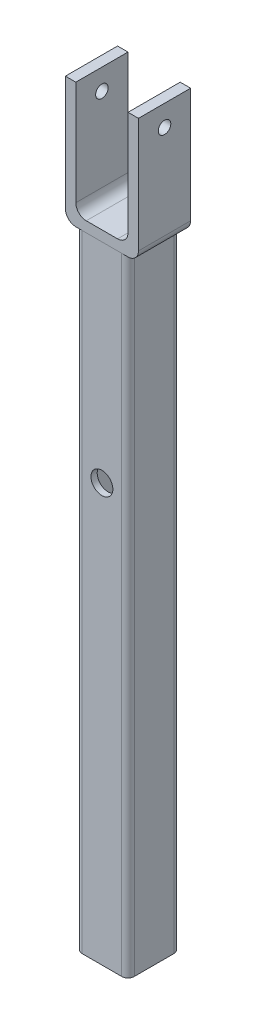
ISO-10303-21;
HEADER;
FILE_DESCRIPTION(('STEP AP214'),'2;1');
FILE_NAME('part.step','',(''),(''),'','','');
FILE_SCHEMA(('AUTOMOTIVE_DESIGN { 1 0 10303 214 1 1 1 1 }'));
ENDSEC;
DATA;
#1=APPLICATION_CONTEXT('core data for automotive mechanical design processes');
#2=APPLICATION_PROTOCOL_DEFINITION('international standard','automotive_design',2000,#1);
#3=PRODUCT_CONTEXT('',#1,'mechanical');
#4=PRODUCT('Part','Part','',(#3));
#5=PRODUCT_RELATED_PRODUCT_CATEGORY('part','',(#4));
#6=PRODUCT_DEFINITION_FORMATION('','',#4);
#7=PRODUCT_DEFINITION_CONTEXT('part definition',#1,'design');
#8=PRODUCT_DEFINITION('design','',#6,#7);
#9=PRODUCT_DEFINITION_SHAPE('','',#8);
#10=(LENGTH_UNIT() NAMED_UNIT(*) SI_UNIT(.MILLI.,.METRE.));
#11=(NAMED_UNIT(*) PLANE_ANGLE_UNIT() SI_UNIT($,.RADIAN.));
#12=(NAMED_UNIT(*) SI_UNIT($,.STERADIAN.) SOLID_ANGLE_UNIT());
#13=UNCERTAINTY_MEASURE_WITH_UNIT(LENGTH_MEASURE(1.E-05),#10,'distance_accuracy_value','');
#14=(GEOMETRIC_REPRESENTATION_CONTEXT(3) GLOBAL_UNCERTAINTY_ASSIGNED_CONTEXT((#13)) GLOBAL_UNIT_ASSIGNED_CONTEXT((#10,
#11,#12)) REPRESENTATION_CONTEXT('',''));
#15=CARTESIAN_POINT('',(0.,0.,0.));
#16=DIRECTION('',(0.,0.,1.));
#17=DIRECTION('',(1.,0.,0.));
#18=AXIS2_PLACEMENT_3D('',#15,#16,#17);
#19=CARTESIAN_POINT('',(0.,360.,0.));
#20=DIRECTION('',(0.,-1.,0.));
#21=DIRECTION('',(0.,0.,-1.));
#22=AXIS2_PLACEMENT_3D('',#19,#20,#21);
#23=PLANE('',#22);
#24=DIRECTION('',(1.,0.,0.));
#25=VECTOR('',#24,1.);
#26=CARTESIAN_POINT('',(17.5,360.,12.5));
#27=LINE('',#26,#25);
#28=CARTESIAN_POINT('',(-17.5,360.,12.5));
#29=VERTEX_POINT('',#28);
#30=CARTESIAN_POINT('',(-12.5,360.,12.5));
#31=VERTEX_POINT('',#30);
#32=EDGE_CURVE('E144',#29,#31,#27,.T.);
#33=ORIENTED_EDGE('',*,*,#32,.T.);
#34=DIRECTION('',(0.,0.,1.));
#35=VECTOR('',#34,1.);
#36=CARTESIAN_POINT('',(-12.5,360.,12.5));
#37=LINE('',#36,#35);
#38=CARTESIAN_POINT('',(-12.5,360.,-12.5));
#39=VERTEX_POINT('',#38);
#40=EDGE_CURVE('E154',#39,#31,#37,.T.);
#41=ORIENTED_EDGE('',*,*,#40,.F.);
#42=DIRECTION('',(-1.,0.,0.));
#43=VECTOR('',#42,1.);
#44=CARTESIAN_POINT('',(17.5,360.,-12.5));
#45=LINE('',#44,#43);
#46=CARTESIAN_POINT('',(-17.5,360.,-12.5));
#47=VERTEX_POINT('',#46);
#48=EDGE_CURVE('E169',#39,#47,#45,.T.);
#49=ORIENTED_EDGE('',*,*,#48,.T.);
#50=DIRECTION('',(0.,0.,1.));
#51=VECTOR('',#50,1.);
#52=CARTESIAN_POINT('',(-17.5,360.,-12.5));
#53=LINE('',#52,#51);
#54=EDGE_CURVE('E164',#47,#29,#53,.T.);
#55=ORIENTED_EDGE('',*,*,#54,.T.);
#56=EDGE_LOOP('',(#33,#41,#49,#55));
#57=FACE_BOUND('',#56,.T.);
#58=ADVANCED_FACE('F49',(#57),#23,.F.);
#59=CARTESIAN_POINT('',(-17.5,360.,-12.5));
#60=DIRECTION('',(1.,0.,0.));
#61=DIRECTION('',(0.,0.,-1.));
#62=AXIS2_PLACEMENT_3D('',#59,#60,#61);
#63=PLANE('',#62);
#64=CARTESIAN_POINT('',(-17.5,350.,0.));
#65=DIRECTION('',(-1.,0.,0.));
#66=DIRECTION('',(0.,0.,1.));
#67=AXIS2_PLACEMENT_3D('',#64,#65,#66);
#68=CIRCLE('',#67,3.);
#69=CARTESIAN_POINT('',(-17.5,350.,3.));
#70=VERTEX_POINT('',#69);
#71=EDGE_CURVE('E197',#70,#70,#68,.T.);
#72=ORIENTED_EDGE('',*,*,#71,.F.);
#73=EDGE_LOOP('',(#72));
#74=FACE_BOUND('',#73,.T.);
#75=DIRECTION('',(0.,-1.,0.));
#76=VECTOR('',#75,1.);
#77=CARTESIAN_POINT('',(-17.5,360.,-12.5));
#78=LINE('',#77,#76);
#79=CARTESIAN_POINT('',(-17.5,305.,-12.5));
#80=VERTEX_POINT('',#79);
#81=EDGE_CURVE('E176',#47,#80,#78,.T.);
#82=ORIENTED_EDGE('',*,*,#81,.T.);
#83=DIRECTION('',(0.,0.,1.));
#84=VECTOR('',#83,1.);
#85=CARTESIAN_POINT('',(-17.5,305.,12.5));
#86=LINE('',#85,#84);
#87=CARTESIAN_POINT('',(-17.5,305.,12.5));
#88=VERTEX_POINT('',#87);
#89=EDGE_CURVE('E12',#80,#88,#86,.T.);
#90=ORIENTED_EDGE('',*,*,#89,.T.);
#91=DIRECTION('',(0.,-1.,0.));
#92=VECTOR('',#91,1.);
#93=CARTESIAN_POINT('',(-17.5,360.,12.5));
#94=LINE('',#93,#92);
#95=EDGE_CURVE('E190',#29,#88,#94,.T.);
#96=ORIENTED_EDGE('',*,*,#95,.F.);
#97=ORIENTED_EDGE('',*,*,#54,.F.);
#98=EDGE_LOOP('',(#82,#90,#96,#97));
#99=FACE_BOUND('',#98,.T.);
#100=ADVANCED_FACE('F241',(#74,#99),#63,.F.);
#101=CARTESIAN_POINT('',(17.5,360.,12.5));
#102=DIRECTION('',(0.,0.,-1.));
#103=DIRECTION('',(-1.,0.,0.));
#104=AXIS2_PLACEMENT_3D('',#101,#102,#103);
#105=PLANE('',#104);
#106=DIRECTION('',(1.,0.,0.));
#107=VECTOR('',#106,1.);
#108=CARTESIAN_POINT('',(17.5,300.,12.5));
#109=LINE('',#108,#107);
#110=CARTESIAN_POINT('',(-12.5,300.,12.5));
#111=VERTEX_POINT('',#110);
#112=CARTESIAN_POINT('',(12.5,300.,12.5));
#113=VERTEX_POINT('',#112);
#114=EDGE_CURVE('E177',#111,#113,#109,.T.);
#115=ORIENTED_EDGE('',*,*,#114,.T.);
#116=CARTESIAN_POINT('',(12.5,305.,12.5));
#117=DIRECTION('',(0.,0.,-1.));
#118=DIRECTION('',(-1.,0.,0.));
#119=AXIS2_PLACEMENT_3D('',#116,#117,#118);
#120=CIRCLE('',#119,5.);
#121=CARTESIAN_POINT('',(17.5,305.,12.5));
#122=VERTEX_POINT('',#121);
#123=EDGE_CURVE('E57',#113,#122,#120,.F.);
#124=ORIENTED_EDGE('',*,*,#123,.T.);
#125=DIRECTION('',(0.,-1.,0.));
#126=VECTOR('',#125,1.);
#127=CARTESIAN_POINT('',(17.5,360.,12.5));
#128=LINE('',#127,#126);
#129=CARTESIAN_POINT('',(17.5,360.,12.5));
#130=VERTEX_POINT('',#129);
#131=EDGE_CURVE('E187',#130,#122,#128,.T.);
#132=ORIENTED_EDGE('',*,*,#131,.F.);
#133=CARTESIAN_POINT('',(12.5,360.,12.5));
#134=VERTEX_POINT('',#133);
#135=EDGE_CURVE('E167',#134,#130,#27,.T.);
#136=ORIENTED_EDGE('',*,*,#135,.F.);
#137=DIRECTION('',(0.,1.,0.));
#138=VECTOR('',#137,1.);
#139=CARTESIAN_POINT('',(12.5,305.,12.5));
#140=LINE('',#139,#138);
#141=CARTESIAN_POINT('',(12.5,310.,12.5));
#142=VERTEX_POINT('',#141);
#143=EDGE_CURVE('E150',#142,#134,#140,.T.);
#144=ORIENTED_EDGE('',*,*,#143,.F.);
#145=CARTESIAN_POINT('',(7.5,310.,12.5));
#146=DIRECTION('',(0.,0.,-1.));
#147=DIRECTION('',(-1.,0.,0.));
#148=AXIS2_PLACEMENT_3D('',#145,#146,#147);
#149=CIRCLE('',#148,5.);
#150=CARTESIAN_POINT('',(7.5,305.,12.5));
#151=VERTEX_POINT('',#150);
#152=EDGE_CURVE('E209',#142,#151,#149,.T.);
#153=ORIENTED_EDGE('',*,*,#152,.T.);
#154=DIRECTION('',(1.,0.,0.));
#155=VECTOR('',#154,1.);
#156=CARTESIAN_POINT('',(12.5,305.,12.5));
#157=LINE('',#156,#155);
#158=CARTESIAN_POINT('',(-7.49999999999999,305.,12.5));
#159=VERTEX_POINT('',#158);
#160=EDGE_CURVE('E393',#159,#151,#157,.T.);
#161=ORIENTED_EDGE('',*,*,#160,.F.);
#162=CARTESIAN_POINT('',(-7.5,310.,12.5));
#163=DIRECTION('',(0.,0.,-1.));
#164=DIRECTION('',(-1.,0.,0.));
#165=AXIS2_PLACEMENT_3D('',#162,#163,#164);
#166=CIRCLE('',#165,5.);
#167=CARTESIAN_POINT('',(-12.5,310.,12.5));
#168=VERTEX_POINT('',#167);
#169=EDGE_CURVE('E147',#159,#168,#166,.T.);
#170=ORIENTED_EDGE('',*,*,#169,.T.);
#171=DIRECTION('',(0.,1.,0.));
#172=VECTOR('',#171,1.);
#173=CARTESIAN_POINT('',(-12.5,305.,12.5));
#174=LINE('',#173,#172);
#175=EDGE_CURVE('E139',#168,#31,#174,.T.);
#176=ORIENTED_EDGE('',*,*,#175,.T.);
#177=ORIENTED_EDGE('',*,*,#32,.F.);
#178=ORIENTED_EDGE('',*,*,#95,.T.);
#179=CARTESIAN_POINT('',(-12.5,305.,12.5));
#180=DIRECTION('',(0.,0.,-1.));
#181=DIRECTION('',(-1.,0.,0.));
#182=AXIS2_PLACEMENT_3D('',#179,#180,#181);
#183=CIRCLE('',#182,5.);
#184=EDGE_CURVE('E64',#88,#111,#183,.F.);
#185=ORIENTED_EDGE('',*,*,#184,.T.);
#186=EDGE_LOOP('',(#115,#124,#132,#136,#144,#153,#161,#170,#176,#177,#178,#185));
#187=FACE_BOUND('',#186,.T.);
#188=ADVANCED_FACE('F141',(#187),#105,.F.);
#189=CARTESIAN_POINT('',(17.5,360.,-12.5));
#190=DIRECTION('',(-1.,0.,0.));
#191=DIRECTION('',(0.,0.,1.));
#192=AXIS2_PLACEMENT_3D('',#189,#190,#191);
#193=PLANE('',#192);
#194=CARTESIAN_POINT('',(17.5,350.,0.));
#195=DIRECTION('',(-1.,0.,0.));
#196=DIRECTION('',(0.,0.,1.));
#197=AXIS2_PLACEMENT_3D('',#194,#195,#196);
#198=CIRCLE('',#197,3.);
#199=CARTESIAN_POINT('',(17.5,350.,3.));
#200=VERTEX_POINT('',#199);
#201=EDGE_CURVE('E161',#200,#200,#198,.T.);
#202=ORIENTED_EDGE('',*,*,#201,.T.);
#203=EDGE_LOOP('',(#202));
#204=FACE_BOUND('',#203,.T.);
#205=ORIENTED_EDGE('',*,*,#131,.T.);
#206=DIRECTION('',(0.,0.,-1.));
#207=VECTOR('',#206,1.);
#208=CARTESIAN_POINT('',(17.5,305.,-12.5));
#209=LINE('',#208,#207);
#210=CARTESIAN_POINT('',(17.5,305.,-12.5));
#211=VERTEX_POINT('',#210);
#212=EDGE_CURVE('E214',#122,#211,#209,.T.);
#213=ORIENTED_EDGE('',*,*,#212,.T.);
#214=DIRECTION('',(0.,-1.,0.));
#215=VECTOR('',#214,1.);
#216=CARTESIAN_POINT('',(17.5,360.,-12.5));
#217=LINE('',#216,#215);
#218=CARTESIAN_POINT('',(17.5,360.,-12.5));
#219=VERTEX_POINT('',#218);
#220=EDGE_CURVE('E184',#219,#211,#217,.T.);
#221=ORIENTED_EDGE('',*,*,#220,.F.);
#222=DIRECTION('',(0.,0.,-1.));
#223=VECTOR('',#222,1.);
#224=CARTESIAN_POINT('',(17.5,360.,-12.5));
#225=LINE('',#224,#223);
#226=EDGE_CURVE('E166',#130,#219,#225,.T.);
#227=ORIENTED_EDGE('',*,*,#226,.F.);
#228=EDGE_LOOP('',(#205,#213,#221,#227));
#229=FACE_BOUND('',#228,.T.);
#230=ADVANCED_FACE('F231',(#204,#229),#193,.F.);
#231=CARTESIAN_POINT('',(17.5,360.,-12.5));
#232=DIRECTION('',(0.,0.,1.));
#233=DIRECTION('',(1.,0.,0.));
#234=AXIS2_PLACEMENT_3D('',#231,#232,#233);
#235=PLANE('',#234);
#236=ORIENTED_EDGE('',*,*,#220,.T.);
#237=CARTESIAN_POINT('',(12.5,305.,-12.5));
#238=DIRECTION('',(0.,0.,1.));
#239=DIRECTION('',(1.,0.,0.));
#240=AXIS2_PLACEMENT_3D('',#237,#238,#239);
#241=CIRCLE('',#240,5.);
#242=CARTESIAN_POINT('',(12.5,300.,-12.5));
#243=VERTEX_POINT('',#242);
#244=EDGE_CURVE('E219',#211,#243,#241,.F.);
#245=ORIENTED_EDGE('',*,*,#244,.T.);
#246=DIRECTION('',(-1.,0.,0.));
#247=VECTOR('',#246,1.);
#248=CARTESIAN_POINT('',(17.5,300.,-12.5));
#249=LINE('',#248,#247);
#250=CARTESIAN_POINT('',(-12.5,300.,-12.5));
#251=VERTEX_POINT('',#250);
#252=EDGE_CURVE('E179',#243,#251,#249,.T.);
#253=ORIENTED_EDGE('',*,*,#252,.T.);
#254=CARTESIAN_POINT('',(-12.5,305.,-12.5));
#255=DIRECTION('',(0.,0.,1.));
#256=DIRECTION('',(1.,0.,0.));
#257=AXIS2_PLACEMENT_3D('',#254,#255,#256);
#258=CIRCLE('',#257,5.);
#259=EDGE_CURVE('E217',#251,#80,#258,.F.);
#260=ORIENTED_EDGE('',*,*,#259,.T.);
#261=ORIENTED_EDGE('',*,*,#81,.F.);
#262=ORIENTED_EDGE('',*,*,#48,.F.);
#263=DIRECTION('',(0.,1.,0.));
#264=VECTOR('',#263,1.);
#265=CARTESIAN_POINT('',(-12.5,305.,-12.5));
#266=LINE('',#265,#264);
#267=CARTESIAN_POINT('',(-12.5,310.,-12.5));
#268=VERTEX_POINT('',#267);
#269=EDGE_CURVE('E157',#268,#39,#266,.T.);
#270=ORIENTED_EDGE('',*,*,#269,.F.);
#271=CARTESIAN_POINT('',(-7.5,310.,-12.5));
#272=DIRECTION('',(0.,0.,1.));
#273=DIRECTION('',(1.,0.,0.));
#274=AXIS2_PLACEMENT_3D('',#271,#272,#273);
#275=CIRCLE('',#274,5.);
#276=CARTESIAN_POINT('',(-7.49999999999999,305.,-12.5));
#277=VERTEX_POINT('',#276);
#278=EDGE_CURVE('E212',#268,#277,#275,.T.);
#279=ORIENTED_EDGE('',*,*,#278,.T.);
#280=DIRECTION('',(-1.,0.,0.));
#281=VECTOR('',#280,1.);
#282=CARTESIAN_POINT('',(12.5,305.,-12.5));
#283=LINE('',#282,#281);
#284=CARTESIAN_POINT('',(7.5,305.,-12.5));
#285=VERTEX_POINT('',#284);
#286=EDGE_CURVE('E151',#285,#277,#283,.T.);
#287=ORIENTED_EDGE('',*,*,#286,.F.);
#288=CARTESIAN_POINT('',(7.5,310.,-12.5));
#289=DIRECTION('',(0.,0.,1.));
#290=DIRECTION('',(1.,0.,0.));
#291=AXIS2_PLACEMENT_3D('',#288,#289,#290);
#292=CIRCLE('',#291,5.);
#293=CARTESIAN_POINT('',(12.5,310.,-12.5));
#294=VERTEX_POINT('',#293);
#295=EDGE_CURVE('E207',#285,#294,#292,.T.);
#296=ORIENTED_EDGE('',*,*,#295,.T.);
#297=DIRECTION('',(0.,1.,0.));
#298=VECTOR('',#297,1.);
#299=CARTESIAN_POINT('',(12.5,305.,-12.5));
#300=LINE('',#299,#298);
#301=CARTESIAN_POINT('',(12.5,360.,-12.5));
#302=VERTEX_POINT('',#301);
#303=EDGE_CURVE('E387',#294,#302,#300,.T.);
#304=ORIENTED_EDGE('',*,*,#303,.T.);
#305=EDGE_CURVE('E173',#219,#302,#45,.T.);
#306=ORIENTED_EDGE('',*,*,#305,.F.);
#307=EDGE_LOOP('',(#236,#245,#253,#260,#261,#262,#270,#279,#287,#296,#304,#306));
#308=FACE_BOUND('',#307,.T.);
#309=ADVANCED_FACE('F235',(#308),#235,.F.);
#310=ORIENTED_EDGE('',*,*,#305,.T.);
#311=DIRECTION('',(0.,0.,-1.));
#312=VECTOR('',#311,1.);
#313=CARTESIAN_POINT('',(12.5,360.,12.5));
#314=LINE('',#313,#312);
#315=EDGE_CURVE('E160',#134,#302,#314,.T.);
#316=ORIENTED_EDGE('',*,*,#315,.F.);
#317=ORIENTED_EDGE('',*,*,#135,.T.);
#318=ORIENTED_EDGE('',*,*,#226,.T.);
#319=EDGE_LOOP('',(#310,#316,#317,#318));
#320=FACE_BOUND('',#319,.T.);
#321=ADVANCED_FACE('F251',(#320),#23,.F.);
#322=CARTESIAN_POINT('',(0.,300.,0.));
#323=DIRECTION('',(0.,-1.,0.));
#324=DIRECTION('',(0.,0.,-1.));
#325=AXIS2_PLACEMENT_3D('',#322,#323,#324);
#326=PLANE('',#325);
#327=ORIENTED_EDGE('',*,*,#252,.F.);
#328=DIRECTION('',(0.,0.,-1.));
#329=VECTOR('',#328,1.);
#330=CARTESIAN_POINT('',(12.5,300.,12.5));
#331=LINE('',#330,#329);
#332=EDGE_CURVE('E71',#243,#113,#331,.F.);
#333=ORIENTED_EDGE('',*,*,#332,.T.);
#334=ORIENTED_EDGE('',*,*,#114,.F.);
#335=DIRECTION('',(0.,0.,1.));
#336=VECTOR('',#335,1.);
#337=CARTESIAN_POINT('',(-12.5,300.,-12.5));
#338=LINE('',#337,#336);
#339=EDGE_CURVE('E221',#111,#251,#338,.F.);
#340=ORIENTED_EDGE('',*,*,#339,.T.);
#341=EDGE_LOOP('',(#327,#333,#334,#340));
#342=FACE_BOUND('',#341,.T.);
#343=ADVANCED_FACE('F238',(#342),#326,.T.);
#344=CARTESIAN_POINT('',(-12.5,305.,12.5));
#345=DIRECTION('',(-1.,0.,0.));
#346=DIRECTION('',(0.,0.,1.));
#347=AXIS2_PLACEMENT_3D('',#344,#345,#346);
#348=PLANE('',#347);
#349=CARTESIAN_POINT('',(-12.5,350.,0.));
#350=DIRECTION('',(-1.,0.,0.));
#351=DIRECTION('',(0.,0.,1.));
#352=AXIS2_PLACEMENT_3D('',#349,#350,#351);
#353=CIRCLE('',#352,3.);
#354=CARTESIAN_POINT('',(-12.5,350.,3.));
#355=VERTEX_POINT('',#354);
#356=EDGE_CURVE('E196',#355,#355,#353,.T.);
#357=ORIENTED_EDGE('',*,*,#356,.T.);
#358=EDGE_LOOP('',(#357));
#359=FACE_BOUND('',#358,.T.);
#360=ORIENTED_EDGE('',*,*,#175,.F.);
#361=DIRECTION('',(0.,0.,1.));
#362=VECTOR('',#361,1.);
#363=CARTESIAN_POINT('',(-12.5,310.,12.5));
#364=LINE('',#363,#362);
#365=EDGE_CURVE('E205',#168,#268,#364,.F.);
#366=ORIENTED_EDGE('',*,*,#365,.T.);
#367=ORIENTED_EDGE('',*,*,#269,.T.);
#368=ORIENTED_EDGE('',*,*,#40,.T.);
#369=EDGE_LOOP('',(#360,#366,#367,#368));
#370=FACE_BOUND('',#369,.T.);
#371=ADVANCED_FACE('F155',(#359,#370),#348,.F.);
#372=CARTESIAN_POINT('',(12.5,305.,12.5));
#373=DIRECTION('',(1.,0.,0.));
#374=DIRECTION('',(0.,0.,-1.));
#375=AXIS2_PLACEMENT_3D('',#372,#373,#374);
#376=PLANE('',#375);
#377=CARTESIAN_POINT('',(12.5,350.,0.));
#378=DIRECTION('',(1.,0.,0.));
#379=DIRECTION('',(0.,0.,-1.));
#380=AXIS2_PLACEMENT_3D('',#377,#378,#379);
#381=CIRCLE('',#380,3.);
#382=CARTESIAN_POINT('',(12.5,350.,-3.));
#383=VERTEX_POINT('',#382);
#384=EDGE_CURVE('E193',#383,#383,#381,.T.);
#385=ORIENTED_EDGE('',*,*,#384,.T.);
#386=EDGE_LOOP('',(#385));
#387=FACE_BOUND('',#386,.T.);
#388=ORIENTED_EDGE('',*,*,#303,.F.);
#389=DIRECTION('',(0.,0.,-1.));
#390=VECTOR('',#389,1.);
#391=CARTESIAN_POINT('',(12.5,310.,12.5));
#392=LINE('',#391,#390);
#393=EDGE_CURVE('E203',#294,#142,#392,.F.);
#394=ORIENTED_EDGE('',*,*,#393,.T.);
#395=ORIENTED_EDGE('',*,*,#143,.T.);
#396=ORIENTED_EDGE('',*,*,#315,.T.);
#397=EDGE_LOOP('',(#388,#394,#395,#396));
#398=FACE_BOUND('',#397,.T.);
#399=ADVANCED_FACE('F336',(#387,#398),#376,.F.);
#400=CARTESIAN_POINT('',(0.,305.,0.));
#401=DIRECTION('',(0.,1.,0.));
#402=DIRECTION('',(0.,0.,1.));
#403=AXIS2_PLACEMENT_3D('',#400,#401,#402);
#404=PLANE('',#403);
#405=ORIENTED_EDGE('',*,*,#160,.T.);
#406=DIRECTION('',(0.,0.,-1.));
#407=VECTOR('',#406,1.);
#408=CARTESIAN_POINT('',(7.5,305.,0.));
#409=LINE('',#408,#407);
#410=EDGE_CURVE('E200',#151,#285,#409,.T.);
#411=ORIENTED_EDGE('',*,*,#410,.T.);
#412=ORIENTED_EDGE('',*,*,#286,.T.);
#413=DIRECTION('',(0.,0.,1.));
#414=VECTOR('',#413,1.);
#415=CARTESIAN_POINT('',(-7.5,305.,0.));
#416=LINE('',#415,#414);
#417=EDGE_CURVE('E192',#277,#159,#416,.T.);
#418=ORIENTED_EDGE('',*,*,#417,.T.);
#419=EDGE_LOOP('',(#405,#411,#412,#418));
#420=FACE_BOUND('',#419,.T.);
#421=ADVANCED_FACE('F330',(#420),#404,.T.);
#422=CARTESIAN_POINT('',(37.5,350.,0.));
#423=DIRECTION('',(-1.,0.,0.));
#424=DIRECTION('',(0.,0.,1.));
#425=AXIS2_PLACEMENT_3D('',#422,#423,#424);
#426=CYLINDRICAL_SURFACE('',#425,3.);
#427=ORIENTED_EDGE('',*,*,#384,.F.);
#428=EDGE_LOOP('',(#427));
#429=FACE_BOUND('',#428,.T.);
#430=ORIENTED_EDGE('',*,*,#201,.F.);
#431=EDGE_LOOP('',(#430));
#432=FACE_BOUND('',#431,.T.);
#433=ADVANCED_FACE('F335',(#429,#432),#426,.F.);
#434=ORIENTED_EDGE('',*,*,#71,.T.);
#435=EDGE_LOOP('',(#434));
#436=FACE_BOUND('',#435,.T.);
#437=ORIENTED_EDGE('',*,*,#356,.F.);
#438=EDGE_LOOP('',(#437));
#439=FACE_BOUND('',#438,.T.);
#440=ADVANCED_FACE('F259',(#436,#439),#426,.F.);
#441=CARTESIAN_POINT('',(7.5,310.,0.));
#442=DIRECTION('',(0.,0.,-1.));
#443=DIRECTION('',(-1.,0.,0.));
#444=AXIS2_PLACEMENT_3D('',#441,#442,#443);
#445=CYLINDRICAL_SURFACE('',#444,5.);
#446=ORIENTED_EDGE('',*,*,#152,.F.);
#447=ORIENTED_EDGE('',*,*,#393,.F.);
#448=ORIENTED_EDGE('',*,*,#295,.F.);
#449=ORIENTED_EDGE('',*,*,#410,.F.);
#450=EDGE_LOOP('',(#446,#447,#448,#449));
#451=FACE_BOUND('',#450,.T.);
#452=ADVANCED_FACE('F255',(#451),#445,.F.);
#453=CARTESIAN_POINT('',(-7.5,310.,0.));
#454=DIRECTION('',(0.,0.,1.));
#455=DIRECTION('',(1.,0.,0.));
#456=AXIS2_PLACEMENT_3D('',#453,#454,#455);
#457=CYLINDRICAL_SURFACE('',#456,5.);
#458=ORIENTED_EDGE('',*,*,#278,.F.);
#459=ORIENTED_EDGE('',*,*,#365,.F.);
#460=ORIENTED_EDGE('',*,*,#169,.F.);
#461=ORIENTED_EDGE('',*,*,#417,.F.);
#462=EDGE_LOOP('',(#458,#459,#460,#461));
#463=FACE_BOUND('',#462,.T.);
#464=ADVANCED_FACE('F258',(#463),#457,.F.);
#465=CARTESIAN_POINT('',(12.5,305.,-12.5));
#466=DIRECTION('',(0.,0.,1.));
#467=DIRECTION('',(1.,0.,0.));
#468=AXIS2_PLACEMENT_3D('',#465,#466,#467);
#469=CYLINDRICAL_SURFACE('',#468,5.);
#470=ORIENTED_EDGE('',*,*,#123,.F.);
#471=ORIENTED_EDGE('',*,*,#332,.F.);
#472=ORIENTED_EDGE('',*,*,#244,.F.);
#473=ORIENTED_EDGE('',*,*,#212,.F.);
#474=EDGE_LOOP('',(#470,#471,#472,#473));
#475=FACE_BOUND('',#474,.T.);
#476=ADVANCED_FACE('F233',(#475),#469,.T.);
#477=CARTESIAN_POINT('',(-12.5,305.,-12.5));
#478=DIRECTION('',(0.,0.,-1.));
#479=DIRECTION('',(-1.,0.,0.));
#480=AXIS2_PLACEMENT_3D('',#477,#478,#479);
#481=CYLINDRICAL_SURFACE('',#480,5.);
#482=ORIENTED_EDGE('',*,*,#259,.F.);
#483=ORIENTED_EDGE('',*,*,#339,.F.);
#484=ORIENTED_EDGE('',*,*,#184,.F.);
#485=ORIENTED_EDGE('',*,*,#89,.F.);
#486=EDGE_LOOP('',(#482,#483,#484,#485));
#487=FACE_BOUND('',#486,.T.);
#488=ADVANCED_FACE('F51',(#487),#481,.T.);
#489=CLOSED_SHELL('',(#58,#100,#188,#230,#309,#321,#343,#371,#399,#421,#433,#440,#452,#464,#476,#488));
#490=MANIFOLD_SOLID_BREP('B2',#489);
#491=CARTESIAN_POINT('',(-6.49999999999998,300.,-9.5));
#492=DIRECTION('',(0.,0.,1.));
#493=DIRECTION('',(1.,0.,0.));
#494=AXIS2_PLACEMENT_3D('',#491,#492,#493);
#495=PLANE('',#494);
#496=CARTESIAN_POINT('',(0.,200.,-9.49999999999999));
#497=DIRECTION('',(0.,0.,-1.));
#498=DIRECTION('',(-1.,0.,0.));
#499=AXIS2_PLACEMENT_3D('',#496,#497,#498);
#500=CIRCLE('',#499,7.5);
#501=CARTESIAN_POINT('',(-6.5,203.741657386774,-9.5));
#502=VERTEX_POINT('',#501);
#503=CARTESIAN_POINT('',(6.50000000000001,203.741657386774,-9.5));
#504=VERTEX_POINT('',#503);
#505=EDGE_CURVE('E435',#502,#504,#500,.T.);
#506=ORIENTED_EDGE('',*,*,#505,.T.);
#507=DIRECTION('',(0.,-1.,0.));
#508=VECTOR('',#507,1.);
#509=CARTESIAN_POINT('',(6.5,300.,-9.5));
#510=LINE('',#509,#508);
#511=CARTESIAN_POINT('',(6.5,300.,-9.5));
#512=VERTEX_POINT('',#511);
#513=EDGE_CURVE('E565',#512,#504,#510,.T.);
#514=ORIENTED_EDGE('',*,*,#513,.F.);
#515=DIRECTION('',(-1.,0.,0.));
#516=VECTOR('',#515,1.);
#517=CARTESIAN_POINT('',(-6.49999999999998,300.,-9.5));
#518=LINE('',#517,#516);
#519=CARTESIAN_POINT('',(-6.5,300.,-9.5));
#520=VERTEX_POINT('',#519);
#521=EDGE_CURVE('E807',#512,#520,#518,.T.);
#522=ORIENTED_EDGE('',*,*,#521,.T.);
#523=DIRECTION('',(0.,-1.,0.));
#524=VECTOR('',#523,1.);
#525=CARTESIAN_POINT('',(-6.5,300.,-9.5));
#526=LINE('',#525,#524);
#527=EDGE_CURVE('E568',#520,#502,#526,.T.);
#528=ORIENTED_EDGE('',*,*,#527,.T.);
#529=EDGE_LOOP('',(#506,#514,#522,#528));
#530=FACE_BOUND('',#529,.T.);
#531=ADVANCED_FACE('F419',(#530),#495,.T.);
#532=CARTESIAN_POINT('',(9.50000000000001,300.,-9.5));
#533=DIRECTION('',(0.,1.,0.));
#534=DIRECTION('',(0.,0.,1.));
#535=AXIS2_PLACEMENT_3D('',#532,#533,#534);
#536=PLANE('',#535);
#537=CARTESIAN_POINT('',(9.50000000000001,300.,-9.5));
#538=DIRECTION('',(0.,1.,0.));
#539=DIRECTION('',(0.,0.,1.));
#540=AXIS2_PLACEMENT_3D('',#537,#538,#539);
#541=CIRCLE('',#540,3.);
#542=CARTESIAN_POINT('',(12.5,300.,-9.49999999999998));
#543=VERTEX_POINT('',#542);
#544=CARTESIAN_POINT('',(9.49999999999998,300.,-12.5));
#545=VERTEX_POINT('',#544);
#546=EDGE_CURVE('E587',#543,#545,#541,.T.);
#547=ORIENTED_EDGE('',*,*,#546,.T.);
#548=DIRECTION('',(-1.,0.,0.));
#549=VECTOR('',#548,1.);
#550=CARTESIAN_POINT('',(9.49999999999998,300.,-12.5));
#551=LINE('',#550,#549);
#552=CARTESIAN_POINT('',(-9.50000000000001,300.,-12.5));
#553=VERTEX_POINT('',#552);
#554=EDGE_CURVE('E591',#545,#553,#551,.T.);
#555=ORIENTED_EDGE('',*,*,#554,.T.);
#556=CARTESIAN_POINT('',(-9.50000000000001,300.,-9.49999999999999));
#557=DIRECTION('',(0.,1.,0.));
#558=DIRECTION('',(0.,0.,-1.));
#559=AXIS2_PLACEMENT_3D('',#556,#557,#558);
#560=CIRCLE('',#559,3.);
#561=CARTESIAN_POINT('',(-12.5,300.,-9.49999999999997));
#562=VERTEX_POINT('',#561);
#563=EDGE_CURVE('E595',#553,#562,#560,.T.);
#564=ORIENTED_EDGE('',*,*,#563,.T.);
#565=DIRECTION('',(0.,0.,1.));
#566=VECTOR('',#565,1.);
#567=CARTESIAN_POINT('',(-12.5,300.,-9.49999999999997));
#568=LINE('',#567,#566);
#569=CARTESIAN_POINT('',(-12.5,300.,9.49999999999999));
#570=VERTEX_POINT('',#569);
#571=EDGE_CURVE('E598',#562,#570,#568,.T.);
#572=ORIENTED_EDGE('',*,*,#571,.T.);
#573=CARTESIAN_POINT('',(-9.50000000000001,300.,9.50000000000001));
#574=DIRECTION('',(0.,1.,0.));
#575=DIRECTION('',(0.,0.,-1.));
#576=AXIS2_PLACEMENT_3D('',#573,#574,#575);
#577=CIRCLE('',#576,3.);
#578=CARTESIAN_POINT('',(-9.49999999999999,300.,12.5));
#579=VERTEX_POINT('',#578);
#580=EDGE_CURVE('E601',#570,#579,#577,.T.);
#581=ORIENTED_EDGE('',*,*,#580,.T.);
#582=DIRECTION('',(1.,0.,0.));
#583=VECTOR('',#582,1.);
#584=CARTESIAN_POINT('',(9.49999999999999,300.,12.5));
#585=LINE('',#584,#583);
#586=CARTESIAN_POINT('',(9.49999999999999,300.,12.5));
#587=VERTEX_POINT('',#586);
#588=EDGE_CURVE('E604',#579,#587,#585,.T.);
#589=ORIENTED_EDGE('',*,*,#588,.T.);
#590=CARTESIAN_POINT('',(9.50000000000001,300.,9.50000000000001));
#591=DIRECTION('',(0.,1.,0.));
#592=DIRECTION('',(0.,0.,1.));
#593=AXIS2_PLACEMENT_3D('',#590,#591,#592);
#594=CIRCLE('',#593,3.);
#595=CARTESIAN_POINT('',(12.5,300.,9.49999999999998));
#596=VERTEX_POINT('',#595);
#597=EDGE_CURVE('E607',#587,#596,#594,.T.);
#598=ORIENTED_EDGE('',*,*,#597,.T.);
#599=DIRECTION('',(0.,0.,-1.));
#600=VECTOR('',#599,1.);
#601=CARTESIAN_POINT('',(12.5,300.,-9.49999999999998));
#602=LINE('',#601,#600);
#603=EDGE_CURVE('E610',#596,#543,#602,.T.);
#604=ORIENTED_EDGE('',*,*,#603,.T.);
#605=EDGE_LOOP('',(#547,#555,#564,#572,#581,#589,#598,#604));
#606=FACE_BOUND('',#605,.T.);
#607=ORIENTED_EDGE('',*,*,#521,.F.);
#608=CARTESIAN_POINT('',(6.5,300.,-6.5));
#609=DIRECTION('',(0.,1.,0.));
#610=DIRECTION('',(0.,0.,1.));
#611=AXIS2_PLACEMENT_3D('',#608,#609,#610);
#612=CIRCLE('',#611,3.);
#613=CARTESIAN_POINT('',(9.5,300.,-6.5));
#614=VERTEX_POINT('',#613);
#615=EDGE_CURVE('E574',#614,#512,#612,.T.);
#616=ORIENTED_EDGE('',*,*,#615,.F.);
#617=DIRECTION('',(0.,0.,-1.));
#618=VECTOR('',#617,1.);
#619=CARTESIAN_POINT('',(9.5,300.,-6.5));
#620=LINE('',#619,#618);
#621=CARTESIAN_POINT('',(9.50000000000001,300.,6.5));
#622=VERTEX_POINT('',#621);
#623=EDGE_CURVE('E761',#622,#614,#620,.T.);
#624=ORIENTED_EDGE('',*,*,#623,.F.);
#625=CARTESIAN_POINT('',(6.50000000000001,300.,6.5));
#626=DIRECTION('',(0.,1.,0.));
#627=DIRECTION('',(0.,0.,-1.));
#628=AXIS2_PLACEMENT_3D('',#625,#626,#627);
#629=CIRCLE('',#628,3.);
#630=CARTESIAN_POINT('',(6.50000000000001,300.,9.5));
#631=VERTEX_POINT('',#630);
#632=EDGE_CURVE('E792',#631,#622,#629,.T.);
#633=ORIENTED_EDGE('',*,*,#632,.F.);
#634=DIRECTION('',(1.,0.,0.));
#635=VECTOR('',#634,1.);
#636=CARTESIAN_POINT('',(-6.5,300.,9.5));
#637=LINE('',#636,#635);
#638=CARTESIAN_POINT('',(-6.5,300.,9.5));
#639=VERTEX_POINT('',#638);
#640=EDGE_CURVE('E795',#639,#631,#637,.T.);
#641=ORIENTED_EDGE('',*,*,#640,.F.);
#642=CARTESIAN_POINT('',(-6.5,300.,6.5));
#643=DIRECTION('',(0.,1.,0.));
#644=DIRECTION('',(0.,0.,-1.));
#645=AXIS2_PLACEMENT_3D('',#642,#643,#644);
#646=CIRCLE('',#645,3.);
#647=CARTESIAN_POINT('',(-9.5,300.,6.5));
#648=VERTEX_POINT('',#647);
#649=EDGE_CURVE('E798',#648,#639,#646,.T.);
#650=ORIENTED_EDGE('',*,*,#649,.F.);
#651=DIRECTION('',(0.,0.,1.));
#652=VECTOR('',#651,1.);
#653=CARTESIAN_POINT('',(-9.5,300.,-6.49999999999998));
#654=LINE('',#653,#652);
#655=CARTESIAN_POINT('',(-9.5,300.,-6.49999999999998));
#656=VERTEX_POINT('',#655);
#657=EDGE_CURVE('E801',#656,#648,#654,.T.);
#658=ORIENTED_EDGE('',*,*,#657,.F.);
#659=CARTESIAN_POINT('',(-6.5,300.,-6.5));
#660=DIRECTION('',(0.,1.,0.));
#661=DIRECTION('',(0.,0.,-1.));
#662=AXIS2_PLACEMENT_3D('',#659,#660,#661);
#663=CIRCLE('',#662,3.);
#664=EDGE_CURVE('E804',#520,#656,#663,.T.);
#665=ORIENTED_EDGE('',*,*,#664,.F.);
#666=EDGE_LOOP('',(#607,#616,#624,#633,#641,#650,#658,#665));
#667=FACE_BOUND('',#666,.T.);
#668=ADVANCED_FACE('F681',(#606,#667),#536,.T.);
#669=CARTESIAN_POINT('',(9.50000000000001,0.,-9.5));
#670=DIRECTION('',(0.,1.,0.));
#671=DIRECTION('',(0.,0.,1.));
#672=AXIS2_PLACEMENT_3D('',#669,#670,#671);
#673=PLANE('',#672);
#674=CARTESIAN_POINT('',(9.50000000000001,0.,-9.5));
#675=DIRECTION('',(0.,1.,0.));
#676=DIRECTION('',(0.,0.,1.));
#677=AXIS2_PLACEMENT_3D('',#674,#675,#676);
#678=CIRCLE('',#677,3.);
#679=CARTESIAN_POINT('',(12.5,0.,-9.49999999999998));
#680=VERTEX_POINT('',#679);
#681=CARTESIAN_POINT('',(9.49999999999998,0.,-12.5));
#682=VERTEX_POINT('',#681);
#683=EDGE_CURVE('E576',#680,#682,#678,.T.);
#684=ORIENTED_EDGE('',*,*,#683,.F.);
#685=DIRECTION('',(0.,0.,-1.));
#686=VECTOR('',#685,1.);
#687=CARTESIAN_POINT('',(12.5,0.,-9.49999999999998));
#688=LINE('',#687,#686);
#689=CARTESIAN_POINT('',(12.5,0.,9.49999999999998));
#690=VERTEX_POINT('',#689);
#691=EDGE_CURVE('E592',#690,#680,#688,.T.);
#692=ORIENTED_EDGE('',*,*,#691,.F.);
#693=CARTESIAN_POINT('',(9.50000000000001,0.,9.50000000000001));
#694=DIRECTION('',(0.,1.,0.));
#695=DIRECTION('',(0.,0.,1.));
#696=AXIS2_PLACEMENT_3D('',#693,#694,#695);
#697=CIRCLE('',#696,3.);
#698=CARTESIAN_POINT('',(9.49999999999999,0.,12.5));
#699=VERTEX_POINT('',#698);
#700=EDGE_CURVE('E628',#699,#690,#697,.T.);
#701=ORIENTED_EDGE('',*,*,#700,.F.);
#702=DIRECTION('',(1.,0.,0.));
#703=VECTOR('',#702,1.);
#704=CARTESIAN_POINT('',(9.49999999999999,0.,12.5));
#705=LINE('',#704,#703);
#706=CARTESIAN_POINT('',(-9.49999999999999,0.,12.5));
#707=VERTEX_POINT('',#706);
#708=EDGE_CURVE('E625',#707,#699,#705,.T.);
#709=ORIENTED_EDGE('',*,*,#708,.F.);
#710=CARTESIAN_POINT('',(-9.50000000000001,0.,9.50000000000001));
#711=DIRECTION('',(0.,1.,0.));
#712=DIRECTION('',(0.,0.,-1.));
#713=AXIS2_PLACEMENT_3D('',#710,#711,#712);
#714=CIRCLE('',#713,3.);
#715=CARTESIAN_POINT('',(-12.5,0.,9.49999999999999));
#716=VERTEX_POINT('',#715);
#717=EDGE_CURVE('E622',#716,#707,#714,.T.);
#718=ORIENTED_EDGE('',*,*,#717,.F.);
#719=DIRECTION('',(0.,0.,1.));
#720=VECTOR('',#719,1.);
#721=CARTESIAN_POINT('',(-12.5,0.,-9.49999999999997));
#722=LINE('',#721,#720);
#723=CARTESIAN_POINT('',(-12.5,0.,-9.49999999999997));
#724=VERTEX_POINT('',#723);
#725=EDGE_CURVE('E619',#724,#716,#722,.T.);
#726=ORIENTED_EDGE('',*,*,#725,.F.);
#727=CARTESIAN_POINT('',(-9.50000000000001,0.,-9.49999999999999));
#728=DIRECTION('',(0.,1.,0.));
#729=DIRECTION('',(0.,0.,-1.));
#730=AXIS2_PLACEMENT_3D('',#727,#728,#729);
#731=CIRCLE('',#730,3.);
#732=CARTESIAN_POINT('',(-9.50000000000001,0.,-12.5));
#733=VERTEX_POINT('',#732);
#734=EDGE_CURVE('E616',#733,#724,#731,.T.);
#735=ORIENTED_EDGE('',*,*,#734,.F.);
#736=DIRECTION('',(-1.,0.,0.));
#737=VECTOR('',#736,1.);
#738=CARTESIAN_POINT('',(9.49999999999998,0.,-12.5));
#739=LINE('',#738,#737);
#740=EDGE_CURVE('E582',#682,#733,#739,.T.);
#741=ORIENTED_EDGE('',*,*,#740,.F.);
#742=EDGE_LOOP('',(#684,#692,#701,#709,#718,#726,#735,#741));
#743=FACE_BOUND('',#742,.T.);
#744=CARTESIAN_POINT('',(6.5,0.,-6.5));
#745=DIRECTION('',(0.,1.,0.));
#746=DIRECTION('',(0.,0.,1.));
#747=AXIS2_PLACEMENT_3D('',#744,#745,#746);
#748=CIRCLE('',#747,3.);
#749=CARTESIAN_POINT('',(9.5,0.,-6.5));
#750=VERTEX_POINT('',#749);
#751=CARTESIAN_POINT('',(6.5,0.,-9.5));
#752=VERTEX_POINT('',#751);
#753=EDGE_CURVE('E554',#750,#752,#748,.T.);
#754=ORIENTED_EDGE('',*,*,#753,.T.);
#755=DIRECTION('',(-1.,0.,0.));
#756=VECTOR('',#755,1.);
#757=CARTESIAN_POINT('',(-6.49999999999998,0.,-9.5));
#758=LINE('',#757,#756);
#759=CARTESIAN_POINT('',(-6.5,0.,-9.5));
#760=VERTEX_POINT('',#759);
#761=EDGE_CURVE('E784',#752,#760,#758,.T.);
#762=ORIENTED_EDGE('',*,*,#761,.T.);
#763=CARTESIAN_POINT('',(-6.5,0.,-6.5));
#764=DIRECTION('',(0.,1.,0.));
#765=DIRECTION('',(0.,0.,-1.));
#766=AXIS2_PLACEMENT_3D('',#763,#764,#765);
#767=CIRCLE('',#766,3.);
#768=CARTESIAN_POINT('',(-9.5,0.,-6.49999999999998));
#769=VERTEX_POINT('',#768);
#770=EDGE_CURVE('E736',#760,#769,#767,.T.);
#771=ORIENTED_EDGE('',*,*,#770,.T.);
#772=DIRECTION('',(0.,0.,1.));
#773=VECTOR('',#772,1.);
#774=CARTESIAN_POINT('',(-9.5,0.,-6.49999999999998));
#775=LINE('',#774,#773);
#776=CARTESIAN_POINT('',(-9.5,0.,6.5));
#777=VERTEX_POINT('',#776);
#778=EDGE_CURVE('E778',#769,#777,#775,.T.);
#779=ORIENTED_EDGE('',*,*,#778,.T.);
#780=CARTESIAN_POINT('',(-6.5,0.,6.5));
#781=DIRECTION('',(0.,1.,0.));
#782=DIRECTION('',(0.,0.,-1.));
#783=AXIS2_PLACEMENT_3D('',#780,#781,#782);
#784=CIRCLE('',#783,3.);
#785=CARTESIAN_POINT('',(-6.5,0.,9.5));
#786=VERTEX_POINT('',#785);
#787=EDGE_CURVE('E774',#777,#786,#784,.T.);
#788=ORIENTED_EDGE('',*,*,#787,.T.);
#789=DIRECTION('',(1.,0.,0.));
#790=VECTOR('',#789,1.);
#791=CARTESIAN_POINT('',(-6.5,0.,9.5));
#792=LINE('',#791,#790);
#793=CARTESIAN_POINT('',(6.50000000000001,0.,9.5));
#794=VERTEX_POINT('',#793);
#795=EDGE_CURVE('E770',#786,#794,#792,.T.);
#796=ORIENTED_EDGE('',*,*,#795,.T.);
#797=CARTESIAN_POINT('',(6.50000000000001,0.,6.5));
#798=DIRECTION('',(0.,1.,0.));
#799=DIRECTION('',(0.,0.,-1.));
#800=AXIS2_PLACEMENT_3D('',#797,#798,#799);
#801=CIRCLE('',#800,3.);
#802=CARTESIAN_POINT('',(9.50000000000001,0.,6.5));
#803=VERTEX_POINT('',#802);
#804=EDGE_CURVE('E766',#794,#803,#801,.T.);
#805=ORIENTED_EDGE('',*,*,#804,.T.);
#806=DIRECTION('',(0.,0.,-1.));
#807=VECTOR('',#806,1.);
#808=CARTESIAN_POINT('',(9.5,0.,-6.5));
#809=LINE('',#808,#807);
#810=EDGE_CURVE('E762',#803,#750,#809,.T.);
#811=ORIENTED_EDGE('',*,*,#810,.T.);
#812=EDGE_LOOP('',(#754,#762,#771,#779,#788,#796,#805,#811));
#813=FACE_BOUND('',#812,.T.);
#814=ADVANCED_FACE('F667',(#743,#813),#673,.F.);
#815=CARTESIAN_POINT('',(9.50000000000001,300.,-9.5));
#816=DIRECTION('',(0.,-1.,0.));
#817=DIRECTION('',(0.,0.,-1.));
#818=AXIS2_PLACEMENT_3D('',#815,#816,#817);
#819=CYLINDRICAL_SURFACE('',#818,3.);
#820=ORIENTED_EDGE('',*,*,#683,.T.);
#821=DIRECTION('',(0.,-1.,0.));
#822=VECTOR('',#821,1.);
#823=CARTESIAN_POINT('',(9.49999999999998,300.,-12.5));
#824=LINE('',#823,#822);
#825=EDGE_CURVE('E47',#545,#682,#824,.T.);
#826=ORIENTED_EDGE('',*,*,#825,.F.);
#827=ORIENTED_EDGE('',*,*,#546,.F.);
#828=DIRECTION('',(0.,-1.,0.));
#829=VECTOR('',#828,1.);
#830=CARTESIAN_POINT('',(12.5,300.,-9.49999999999998));
#831=LINE('',#830,#829);
#832=EDGE_CURVE('E612',#543,#680,#831,.T.);
#833=ORIENTED_EDGE('',*,*,#832,.T.);
#834=EDGE_LOOP('',(#820,#826,#827,#833));
#835=FACE_BOUND('',#834,.T.);
#836=ADVANCED_FACE('F421',(#835),#819,.T.);
#837=CARTESIAN_POINT('',(9.49999999999998,300.,-12.5));
#838=DIRECTION('',(0.,0.,1.));
#839=DIRECTION('',(1.,0.,0.));
#840=AXIS2_PLACEMENT_3D('',#837,#838,#839);
#841=PLANE('',#840);
#842=CARTESIAN_POINT('',(0.,200.,-12.5));
#843=DIRECTION('',(0.,0.,-1.));
#844=DIRECTION('',(-1.,0.,0.));
#845=AXIS2_PLACEMENT_3D('',#842,#843,#844);
#846=CIRCLE('',#845,7.5);
#847=CARTESIAN_POINT('',(-7.50000000000001,200.,-12.5));
#848=VERTEX_POINT('',#847);
#849=EDGE_CURVE('E812',#848,#848,#846,.T.);
#850=ORIENTED_EDGE('',*,*,#849,.F.);
#851=EDGE_LOOP('',(#850));
#852=FACE_BOUND('',#851,.T.);
#853=ORIENTED_EDGE('',*,*,#740,.T.);
#854=DIRECTION('',(0.,-1.,0.));
#855=VECTOR('',#854,1.);
#856=CARTESIAN_POINT('',(-9.50000000000001,300.,-12.5));
#857=LINE('',#856,#855);
#858=EDGE_CURVE('E428',#553,#733,#857,.T.);
#859=ORIENTED_EDGE('',*,*,#858,.F.);
#860=ORIENTED_EDGE('',*,*,#554,.F.);
#861=ORIENTED_EDGE('',*,*,#825,.T.);
#862=EDGE_LOOP('',(#853,#859,#860,#861));
#863=FACE_BOUND('',#862,.T.);
#864=ADVANCED_FACE('F686',(#852,#863),#841,.F.);
#865=CARTESIAN_POINT('',(-9.50000000000001,300.,-9.49999999999999));
#866=DIRECTION('',(0.,-1.,0.));
#867=DIRECTION('',(0.,0.,-1.));
#868=AXIS2_PLACEMENT_3D('',#865,#866,#867);
#869=CYLINDRICAL_SURFACE('',#868,3.);
#870=ORIENTED_EDGE('',*,*,#734,.T.);
#871=DIRECTION('',(0.,-1.,0.));
#872=VECTOR('',#871,1.);
#873=CARTESIAN_POINT('',(-12.5,300.,-9.49999999999997));
#874=LINE('',#873,#872);
#875=EDGE_CURVE('E652',#562,#724,#874,.T.);
#876=ORIENTED_EDGE('',*,*,#875,.F.);
#877=ORIENTED_EDGE('',*,*,#563,.F.);
#878=ORIENTED_EDGE('',*,*,#858,.T.);
#879=EDGE_LOOP('',(#870,#876,#877,#878));
#880=FACE_BOUND('',#879,.T.);
#881=ADVANCED_FACE('F661',(#880),#869,.T.);
#882=CARTESIAN_POINT('',(-12.5,300.,-9.49999999999997));
#883=DIRECTION('',(1.,0.,0.));
#884=DIRECTION('',(0.,0.,-1.));
#885=AXIS2_PLACEMENT_3D('',#882,#883,#884);
#886=PLANE('',#885);
#887=ORIENTED_EDGE('',*,*,#725,.T.);
#888=DIRECTION('',(0.,-1.,0.));
#889=VECTOR('',#888,1.);
#890=CARTESIAN_POINT('',(-12.5,300.,9.49999999999999));
#891=LINE('',#890,#889);
#892=EDGE_CURVE('E648',#570,#716,#891,.T.);
#893=ORIENTED_EDGE('',*,*,#892,.F.);
#894=ORIENTED_EDGE('',*,*,#571,.F.);
#895=ORIENTED_EDGE('',*,*,#875,.T.);
#896=EDGE_LOOP('',(#887,#893,#894,#895));
#897=FACE_BOUND('',#896,.T.);
#898=ADVANCED_FACE('F673',(#897),#886,.F.);
#899=CARTESIAN_POINT('',(-9.50000000000001,300.,9.50000000000001));
#900=DIRECTION('',(0.,-1.,0.));
#901=DIRECTION('',(0.,0.,-1.));
#902=AXIS2_PLACEMENT_3D('',#899,#900,#901);
#903=CYLINDRICAL_SURFACE('',#902,3.);
#904=ORIENTED_EDGE('',*,*,#717,.T.);
#905=DIRECTION('',(0.,-1.,0.));
#906=VECTOR('',#905,1.);
#907=CARTESIAN_POINT('',(-9.49999999999999,300.,12.5));
#908=LINE('',#907,#906);
#909=EDGE_CURVE('E644',#579,#707,#908,.T.);
#910=ORIENTED_EDGE('',*,*,#909,.F.);
#911=ORIENTED_EDGE('',*,*,#580,.F.);
#912=ORIENTED_EDGE('',*,*,#892,.T.);
#913=EDGE_LOOP('',(#904,#910,#911,#912));
#914=FACE_BOUND('',#913,.T.);
#915=ADVANCED_FACE('F677',(#914),#903,.T.);
#916=CARTESIAN_POINT('',(9.49999999999999,300.,12.5));
#917=DIRECTION('',(0.,0.,-1.));
#918=DIRECTION('',(-1.,0.,0.));
#919=AXIS2_PLACEMENT_3D('',#916,#917,#918);
#920=PLANE('',#919);
#921=CARTESIAN_POINT('',(0.,200.,12.5));
#922=DIRECTION('',(0.,0.,1.));
#923=DIRECTION('',(1.,0.,0.));
#924=AXIS2_PLACEMENT_3D('',#921,#922,#923);
#925=CIRCLE('',#924,5.25);
#926=CARTESIAN_POINT('',(5.25,200.,12.5));
#927=VERTEX_POINT('',#926);
#928=EDGE_CURVE('E817',#927,#927,#925,.T.);
#929=ORIENTED_EDGE('',*,*,#928,.F.);
#930=EDGE_LOOP('',(#929));
#931=FACE_BOUND('',#930,.T.);
#932=ORIENTED_EDGE('',*,*,#708,.T.);
#933=DIRECTION('',(0.,-1.,0.));
#934=VECTOR('',#933,1.);
#935=CARTESIAN_POINT('',(9.49999999999999,300.,12.5));
#936=LINE('',#935,#934);
#937=EDGE_CURVE('E640',#587,#699,#936,.T.);
#938=ORIENTED_EDGE('',*,*,#937,.F.);
#939=ORIENTED_EDGE('',*,*,#588,.F.);
#940=ORIENTED_EDGE('',*,*,#909,.T.);
#941=EDGE_LOOP('',(#932,#938,#939,#940));
#942=FACE_BOUND('',#941,.T.);
#943=ADVANCED_FACE('F699',(#931,#942),#920,.F.);
#944=CARTESIAN_POINT('',(9.50000000000001,300.,9.50000000000001));
#945=DIRECTION('',(0.,-1.,0.));
#946=DIRECTION('',(0.,0.,-1.));
#947=AXIS2_PLACEMENT_3D('',#944,#945,#946);
#948=CYLINDRICAL_SURFACE('',#947,3.);
#949=ORIENTED_EDGE('',*,*,#700,.T.);
#950=DIRECTION('',(0.,-1.,0.));
#951=VECTOR('',#950,1.);
#952=CARTESIAN_POINT('',(12.5,300.,9.49999999999998));
#953=LINE('',#952,#951);
#954=EDGE_CURVE('E636',#596,#690,#953,.T.);
#955=ORIENTED_EDGE('',*,*,#954,.F.);
#956=ORIENTED_EDGE('',*,*,#597,.F.);
#957=ORIENTED_EDGE('',*,*,#937,.T.);
#958=EDGE_LOOP('',(#949,#955,#956,#957));
#959=FACE_BOUND('',#958,.T.);
#960=ADVANCED_FACE('F697',(#959),#948,.T.);
#961=CARTESIAN_POINT('',(12.5,300.,-9.49999999999998));
#962=DIRECTION('',(-1.,0.,0.));
#963=DIRECTION('',(0.,0.,1.));
#964=AXIS2_PLACEMENT_3D('',#961,#962,#963);
#965=PLANE('',#964);
#966=ORIENTED_EDGE('',*,*,#691,.T.);
#967=ORIENTED_EDGE('',*,*,#832,.F.);
#968=ORIENTED_EDGE('',*,*,#603,.F.);
#969=ORIENTED_EDGE('',*,*,#954,.T.);
#970=EDGE_LOOP('',(#966,#967,#968,#969));
#971=FACE_BOUND('',#970,.T.);
#972=ADVANCED_FACE('F692',(#971),#965,.F.);
#973=CARTESIAN_POINT('',(6.5,300.,-6.5));
#974=DIRECTION('',(0.,-1.,0.));
#975=DIRECTION('',(0.,0.,-1.));
#976=AXIS2_PLACEMENT_3D('',#973,#974,#975);
#977=CYLINDRICAL_SURFACE('',#976,3.);
#978=ORIENTED_EDGE('',*,*,#753,.F.);
#979=DIRECTION('',(0.,-1.,0.));
#980=VECTOR('',#979,1.);
#981=CARTESIAN_POINT('',(9.5,300.,-6.5));
#982=LINE('',#981,#980);
#983=EDGE_CURVE('E757',#614,#750,#982,.T.);
#984=ORIENTED_EDGE('',*,*,#983,.F.);
#985=ORIENTED_EDGE('',*,*,#615,.T.);
#986=ORIENTED_EDGE('',*,*,#513,.T.);
#987=DIRECTION('',(0.,-1.,0.));
#988=VECTOR('',#987,1.);
#989=CARTESIAN_POINT('',(6.5,300.,-9.5));
#990=LINE('',#989,#988);
#991=CARTESIAN_POINT('',(6.50000000000001,196.258342613226,-9.5));
#992=VERTEX_POINT('',#991);
#993=EDGE_CURVE('E547',#504,#992,#990,.T.);
#994=ORIENTED_EDGE('',*,*,#993,.T.);
#995=EDGE_CURVE('E577',#992,#752,#510,.T.);
#996=ORIENTED_EDGE('',*,*,#995,.T.);
#997=EDGE_LOOP('',(#978,#984,#985,#986,#994,#996));
#998=FACE_BOUND('',#997,.T.);
#999=ADVANCED_FACE('F571',(#998),#977,.F.);
#1000=CARTESIAN_POINT('',(-6.5,196.258342613226,-9.49999999999999));
#1001=VERTEX_POINT('',#1000);
#1002=EDGE_CURVE('E559',#992,#1001,#500,.T.);
#1003=ORIENTED_EDGE('',*,*,#1002,.T.);
#1004=EDGE_CURVE('E730',#1001,#760,#526,.T.);
#1005=ORIENTED_EDGE('',*,*,#1004,.T.);
#1006=ORIENTED_EDGE('',*,*,#761,.F.);
#1007=ORIENTED_EDGE('',*,*,#995,.F.);
#1008=EDGE_LOOP('',(#1003,#1005,#1006,#1007));
#1009=FACE_BOUND('',#1008,.T.);
#1010=ADVANCED_FACE('F712',(#1009),#495,.T.);
#1011=CARTESIAN_POINT('',(-6.5,300.,-6.5));
#1012=DIRECTION('',(0.,-1.,0.));
#1013=DIRECTION('',(0.,0.,-1.));
#1014=AXIS2_PLACEMENT_3D('',#1011,#1012,#1013);
#1015=CYLINDRICAL_SURFACE('',#1014,3.);
#1016=ORIENTED_EDGE('',*,*,#770,.F.);
#1017=ORIENTED_EDGE('',*,*,#1004,.F.);
#1018=EDGE_CURVE('E734',#502,#1001,#526,.T.);
#1019=ORIENTED_EDGE('',*,*,#1018,.F.);
#1020=ORIENTED_EDGE('',*,*,#527,.F.);
#1021=ORIENTED_EDGE('',*,*,#664,.T.);
#1022=DIRECTION('',(0.,-1.,0.));
#1023=VECTOR('',#1022,1.);
#1024=CARTESIAN_POINT('',(-9.5,300.,-6.49999999999998));
#1025=LINE('',#1024,#1023);
#1026=EDGE_CURVE('E739',#656,#769,#1025,.T.);
#1027=ORIENTED_EDGE('',*,*,#1026,.T.);
#1028=EDGE_LOOP('',(#1016,#1017,#1019,#1020,#1021,#1027));
#1029=FACE_BOUND('',#1028,.T.);
#1030=ADVANCED_FACE('F720',(#1029),#1015,.F.);
#1031=CARTESIAN_POINT('',(-9.5,300.,-6.49999999999998));
#1032=DIRECTION('',(1.,0.,0.));
#1033=DIRECTION('',(0.,0.,-1.));
#1034=AXIS2_PLACEMENT_3D('',#1031,#1032,#1033);
#1035=PLANE('',#1034);
#1036=ORIENTED_EDGE('',*,*,#778,.F.);
#1037=ORIENTED_EDGE('',*,*,#1026,.F.);
#1038=ORIENTED_EDGE('',*,*,#657,.T.);
#1039=DIRECTION('',(0.,-1.,0.));
#1040=VECTOR('',#1039,1.);
#1041=CARTESIAN_POINT('',(-9.5,300.,6.5));
#1042=LINE('',#1041,#1040);
#1043=EDGE_CURVE('E742',#648,#777,#1042,.T.);
#1044=ORIENTED_EDGE('',*,*,#1043,.T.);
#1045=EDGE_LOOP('',(#1036,#1037,#1038,#1044));
#1046=FACE_BOUND('',#1045,.T.);
#1047=ADVANCED_FACE('F726',(#1046),#1035,.T.);
#1048=CARTESIAN_POINT('',(-6.5,300.,6.5));
#1049=DIRECTION('',(0.,-1.,0.));
#1050=DIRECTION('',(0.,0.,-1.));
#1051=AXIS2_PLACEMENT_3D('',#1048,#1049,#1050);
#1052=CYLINDRICAL_SURFACE('',#1051,3.);
#1053=ORIENTED_EDGE('',*,*,#787,.F.);
#1054=ORIENTED_EDGE('',*,*,#1043,.F.);
#1055=ORIENTED_EDGE('',*,*,#649,.T.);
#1056=DIRECTION('',(0.,-1.,0.));
#1057=VECTOR('',#1056,1.);
#1058=CARTESIAN_POINT('',(-6.5,300.,9.5));
#1059=LINE('',#1058,#1057);
#1060=EDGE_CURVE('E747',#639,#786,#1059,.T.);
#1061=ORIENTED_EDGE('',*,*,#1060,.T.);
#1062=EDGE_LOOP('',(#1053,#1054,#1055,#1061));
#1063=FACE_BOUND('',#1062,.T.);
#1064=ADVANCED_FACE('F849',(#1063),#1052,.F.);
#1065=CARTESIAN_POINT('',(-6.5,300.,9.5));
#1066=DIRECTION('',(0.,0.,-1.));
#1067=DIRECTION('',(-1.,0.,0.));
#1068=AXIS2_PLACEMENT_3D('',#1065,#1066,#1067);
#1069=PLANE('',#1068);
#1070=CARTESIAN_POINT('',(0.,200.,9.50000000000001));
#1071=DIRECTION('',(0.,0.,1.));
#1072=DIRECTION('',(1.,0.,0.));
#1073=AXIS2_PLACEMENT_3D('',#1070,#1071,#1072);
#1074=CIRCLE('',#1073,5.25);
#1075=CARTESIAN_POINT('',(5.25,200.,9.50000000000001));
#1076=VERTEX_POINT('',#1075);
#1077=EDGE_CURVE('E815',#1076,#1076,#1074,.T.);
#1078=ORIENTED_EDGE('',*,*,#1077,.T.);
#1079=EDGE_LOOP('',(#1078));
#1080=FACE_BOUND('',#1079,.T.);
#1081=ORIENTED_EDGE('',*,*,#795,.F.);
#1082=ORIENTED_EDGE('',*,*,#1060,.F.);
#1083=ORIENTED_EDGE('',*,*,#640,.T.);
#1084=DIRECTION('',(0.,-1.,0.));
#1085=VECTOR('',#1084,1.);
#1086=CARTESIAN_POINT('',(6.50000000000001,300.,9.5));
#1087=LINE('',#1086,#1085);
#1088=EDGE_CURVE('E752',#631,#794,#1087,.T.);
#1089=ORIENTED_EDGE('',*,*,#1088,.T.);
#1090=EDGE_LOOP('',(#1081,#1082,#1083,#1089));
#1091=FACE_BOUND('',#1090,.T.);
#1092=ADVANCED_FACE('F825',(#1080,#1091),#1069,.T.);
#1093=CARTESIAN_POINT('',(6.50000000000001,300.,6.5));
#1094=DIRECTION('',(0.,-1.,0.));
#1095=DIRECTION('',(0.,0.,-1.));
#1096=AXIS2_PLACEMENT_3D('',#1093,#1094,#1095);
#1097=CYLINDRICAL_SURFACE('',#1096,3.);
#1098=ORIENTED_EDGE('',*,*,#804,.F.);
#1099=ORIENTED_EDGE('',*,*,#1088,.F.);
#1100=ORIENTED_EDGE('',*,*,#632,.T.);
#1101=DIRECTION('',(0.,-1.,0.));
#1102=VECTOR('',#1101,1.);
#1103=CARTESIAN_POINT('',(9.50000000000001,300.,6.5));
#1104=LINE('',#1103,#1102);
#1105=EDGE_CURVE('E443',#622,#803,#1104,.T.);
#1106=ORIENTED_EDGE('',*,*,#1105,.T.);
#1107=EDGE_LOOP('',(#1098,#1099,#1100,#1106));
#1108=FACE_BOUND('',#1107,.T.);
#1109=ADVANCED_FACE('F843',(#1108),#1097,.F.);
#1110=CARTESIAN_POINT('',(9.5,300.,-6.5));
#1111=DIRECTION('',(-1.,0.,0.));
#1112=DIRECTION('',(0.,0.,1.));
#1113=AXIS2_PLACEMENT_3D('',#1110,#1111,#1112);
#1114=PLANE('',#1113);
#1115=ORIENTED_EDGE('',*,*,#810,.F.);
#1116=ORIENTED_EDGE('',*,*,#1105,.F.);
#1117=ORIENTED_EDGE('',*,*,#623,.T.);
#1118=ORIENTED_EDGE('',*,*,#983,.T.);
#1119=EDGE_LOOP('',(#1115,#1116,#1117,#1118));
#1120=FACE_BOUND('',#1119,.T.);
#1121=ADVANCED_FACE('F840',(#1120),#1114,.T.);
#1122=CARTESIAN_POINT('',(0.,200.,-9.49999999999999));
#1123=DIRECTION('',(0.,0.,-1.));
#1124=DIRECTION('',(-1.,0.,0.));
#1125=AXIS2_PLACEMENT_3D('',#1122,#1123,#1124);
#1126=PLANE('',#1125);
#1127=ORIENTED_EDGE('',*,*,#1018,.T.);
#1128=EDGE_CURVE('E570',#1001,#502,#500,.T.);
#1129=ORIENTED_EDGE('',*,*,#1128,.T.);
#1130=EDGE_LOOP('',(#1127,#1129));
#1131=FACE_BOUND('',#1130,.T.);
#1132=ADVANCED_FACE('F836',(#1131),#1126,.T.);
#1133=CARTESIAN_POINT('',(0.,200.,-9.49999999999999));
#1134=DIRECTION('',(0.,0.,-1.));
#1135=DIRECTION('',(-1.,0.,0.));
#1136=AXIS2_PLACEMENT_3D('',#1133,#1134,#1135);
#1137=CYLINDRICAL_SURFACE('',#1136,7.5);
#1138=ORIENTED_EDGE('',*,*,#505,.F.);
#1139=ORIENTED_EDGE('',*,*,#1128,.F.);
#1140=ORIENTED_EDGE('',*,*,#1002,.F.);
#1141=EDGE_CURVE('E549',#504,#992,#500,.T.);
#1142=ORIENTED_EDGE('',*,*,#1141,.F.);
#1143=EDGE_LOOP('',(#1138,#1139,#1140,#1142));
#1144=FACE_BOUND('',#1143,.T.);
#1145=ORIENTED_EDGE('',*,*,#849,.T.);
#1146=EDGE_LOOP('',(#1145));
#1147=FACE_BOUND('',#1146,.T.);
#1148=ADVANCED_FACE('F556',(#1144,#1147),#1137,.F.);
#1149=ORIENTED_EDGE('',*,*,#1141,.T.);
#1150=ORIENTED_EDGE('',*,*,#993,.F.);
#1151=EDGE_LOOP('',(#1149,#1150));
#1152=FACE_BOUND('',#1151,.T.);
#1153=ADVANCED_FACE('F548',(#1152),#1126,.T.);
#1154=CARTESIAN_POINT('',(0.,200.,9.50000000000001));
#1155=DIRECTION('',(0.,0.,1.));
#1156=DIRECTION('',(1.,0.,0.));
#1157=AXIS2_PLACEMENT_3D('',#1154,#1155,#1156);
#1158=CYLINDRICAL_SURFACE('',#1157,5.25);
#1159=ORIENTED_EDGE('',*,*,#1077,.F.);
#1160=EDGE_LOOP('',(#1159));
#1161=FACE_BOUND('',#1160,.T.);
#1162=ORIENTED_EDGE('',*,*,#928,.T.);
#1163=EDGE_LOOP('',(#1162));
#1164=FACE_BOUND('',#1163,.T.);
#1165=ADVANCED_FACE('F828',(#1161,#1164),#1158,.F.);
#1166=CLOSED_SHELL('',(#531,#668,#814,#836,#864,#881,#898,#915,#943,#960,#972,#999,#1010,#1030,
#1047,#1064,#1092,#1109,#1121,#1132,#1148,#1153,#1165));
#1167=MANIFOLD_SOLID_BREP('B6',#1166);
#1168=ADVANCED_BREP_SHAPE_REPRESENTATION('',(#18,#490,#1167),#14);
#1169=SHAPE_DEFINITION_REPRESENTATION(#9,#1168);
ENDSEC;
END-ISO-10303-21;
